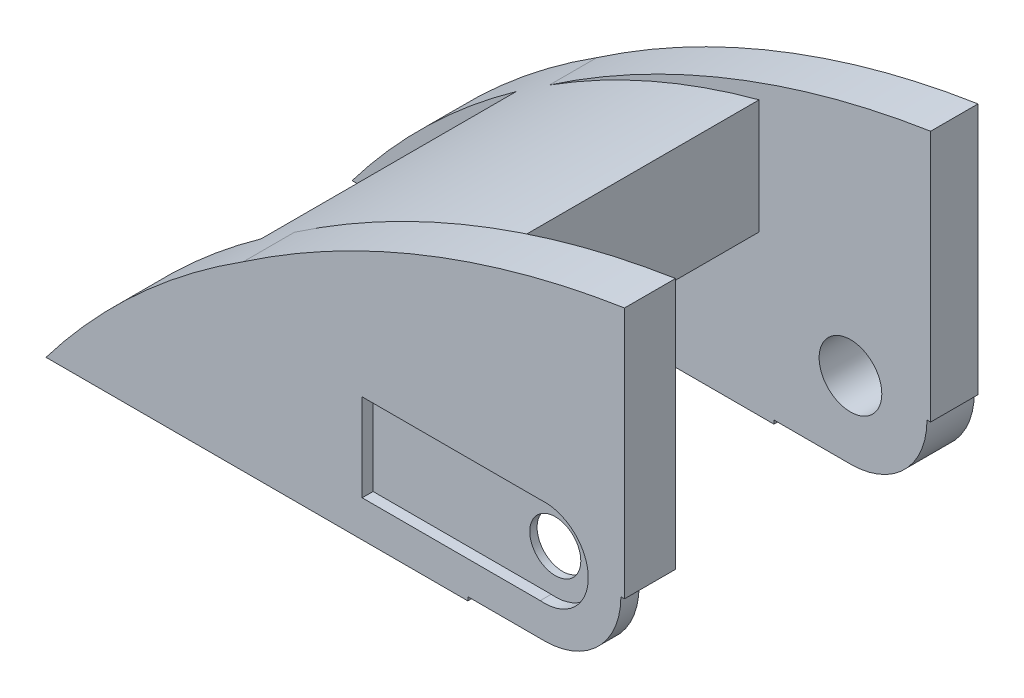
ISO-10303-21;
HEADER;
FILE_DESCRIPTION(('STEP AP214'),'2;1');
FILE_NAME('part.step','',(''),(''),'','','');
FILE_SCHEMA(('AUTOMOTIVE_DESIGN { 1 0 10303 214 1 1 1 1 }'));
ENDSEC;
DATA;
#1=APPLICATION_CONTEXT('core data for automotive mechanical design processes');
#2=APPLICATION_PROTOCOL_DEFINITION('international standard','automotive_design',2000,#1);
#3=PRODUCT_CONTEXT('',#1,'mechanical');
#4=PRODUCT('Part','Part','',(#3));
#5=PRODUCT_RELATED_PRODUCT_CATEGORY('part','',(#4));
#6=PRODUCT_DEFINITION_FORMATION('','',#4);
#7=PRODUCT_DEFINITION_CONTEXT('part definition',#1,'design');
#8=PRODUCT_DEFINITION('design','',#6,#7);
#9=PRODUCT_DEFINITION_SHAPE('','',#8);
#10=(LENGTH_UNIT() NAMED_UNIT(*) SI_UNIT(.MILLI.,.METRE.));
#11=(NAMED_UNIT(*) PLANE_ANGLE_UNIT() SI_UNIT($,.RADIAN.));
#12=(NAMED_UNIT(*) SI_UNIT($,.STERADIAN.) SOLID_ANGLE_UNIT());
#13=UNCERTAINTY_MEASURE_WITH_UNIT(LENGTH_MEASURE(1.E-05),#10,'distance_accuracy_value','');
#14=(GEOMETRIC_REPRESENTATION_CONTEXT(3) GLOBAL_UNCERTAINTY_ASSIGNED_CONTEXT((#13)) GLOBAL_UNIT_ASSIGNED_CONTEXT((#10,
#11,#12)) REPRESENTATION_CONTEXT('',''));
#15=CARTESIAN_POINT('',(0.,0.,0.));
#16=DIRECTION('',(0.,0.,1.));
#17=DIRECTION('',(1.,0.,0.));
#18=AXIS2_PLACEMENT_3D('',#15,#16,#17);
#19=CARTESIAN_POINT('',(0.,0.,-48.5));
#20=DIRECTION('',(0.,0.,1.));
#21=DIRECTION('',(1.,0.,0.));
#22=AXIS2_PLACEMENT_3D('',#19,#20,#21);
#23=CYLINDRICAL_SURFACE('',#22,3.5);
#24=CARTESIAN_POINT('',(0.,0.,-2.5));
#25=DIRECTION('',(0.,0.,-1.));
#26=DIRECTION('',(0.,1.,0.));
#27=AXIS2_PLACEMENT_3D('',#24,#25,#26);
#28=CIRCLE('',#27,3.5);
#29=CARTESIAN_POINT('',(3.5,0.,-2.5));
#30=VERTEX_POINT('',#29);
#31=EDGE_CURVE('E53',#30,#30,#28,.T.);
#32=CARTESIAN_POINT('',(0.,0.,-1.5));
#33=DIRECTION('',(0.,0.,1.));
#34=DIRECTION('',(1.,0.,0.));
#35=AXIS2_PLACEMENT_3D('',#32,#33,#34);
#36=CIRCLE('',#35,3.5);
#37=CARTESIAN_POINT('',(3.5,0.,-1.49999999999999));
#38=VERTEX_POINT('',#37);
#39=EDGE_CURVE('E233',#38,#38,#36,.F.);
#40=CARTESIAN_POINT('',(3.5,0.,-2.5));
#41=CARTESIAN_POINT('',(3.5,0.,-2.48958333333333));
#42=CARTESIAN_POINT('',(3.5,0.,-2.47916666666666));
#43=CARTESIAN_POINT('',(3.5,0.,-2.45833333333333));
#44=CARTESIAN_POINT('',(3.5,0.,-2.44791666666666));
#45=CARTESIAN_POINT('',(3.5,0.,-2.42708333333333));
#46=CARTESIAN_POINT('',(3.5,0.,-2.41666666666666));
#47=CARTESIAN_POINT('',(3.5,0.,-2.39583333333333));
#48=CARTESIAN_POINT('',(3.5,0.,-2.38541666666666));
#49=CARTESIAN_POINT('',(3.5,0.,-2.36458333333333));
#50=CARTESIAN_POINT('',(3.5,0.,-2.35416666666666));
#51=CARTESIAN_POINT('',(3.5,0.,-2.33333333333333));
#52=CARTESIAN_POINT('',(3.5,0.,-2.32291666666666));
#53=CARTESIAN_POINT('',(3.5,0.,-2.30208333333333));
#54=CARTESIAN_POINT('',(3.5,0.,-2.29166666666666));
#55=CARTESIAN_POINT('',(3.5,0.,-2.27083333333333));
#56=CARTESIAN_POINT('',(3.5,0.,-2.26041666666666));
#57=CARTESIAN_POINT('',(3.5,0.,-2.23958333333333));
#58=CARTESIAN_POINT('',(3.5,0.,-2.22916666666666));
#59=CARTESIAN_POINT('',(3.5,0.,-2.20833333333333));
#60=CARTESIAN_POINT('',(3.5,0.,-2.19791666666666));
#61=CARTESIAN_POINT('',(3.5,0.,-2.17708333333333));
#62=CARTESIAN_POINT('',(3.5,0.,-2.16666666666666));
#63=CARTESIAN_POINT('',(3.5,0.,-2.14583333333333));
#64=CARTESIAN_POINT('',(3.5,0.,-2.13541666666666));
#65=CARTESIAN_POINT('',(3.5,0.,-2.11458333333333));
#66=CARTESIAN_POINT('',(3.5,0.,-2.10416666666666));
#67=CARTESIAN_POINT('',(3.5,0.,-2.08333333333333));
#68=CARTESIAN_POINT('',(3.5,0.,-2.07291666666666));
#69=CARTESIAN_POINT('',(3.5,0.,-2.05208333333333));
#70=CARTESIAN_POINT('',(3.5,0.,-2.04166666666666));
#71=CARTESIAN_POINT('',(3.5,0.,-2.02083333333333));
#72=CARTESIAN_POINT('',(3.5,0.,-2.01041666666666));
#73=CARTESIAN_POINT('',(3.5,0.,-1.98958333333333));
#74=CARTESIAN_POINT('',(3.5,0.,-1.97916666666666));
#75=CARTESIAN_POINT('',(3.5,0.,-1.95833333333333));
#76=CARTESIAN_POINT('',(3.5,0.,-1.94791666666666));
#77=CARTESIAN_POINT('',(3.5,0.,-1.92708333333333));
#78=CARTESIAN_POINT('',(3.5,0.,-1.91666666666666));
#79=CARTESIAN_POINT('',(3.5,0.,-1.89583333333333));
#80=CARTESIAN_POINT('',(3.5,0.,-1.88541666666666));
#81=CARTESIAN_POINT('',(3.5,0.,-1.86458333333333));
#82=CARTESIAN_POINT('',(3.5,0.,-1.85416666666666));
#83=CARTESIAN_POINT('',(3.5,0.,-1.83333333333333));
#84=CARTESIAN_POINT('',(3.5,0.,-1.82291666666666));
#85=CARTESIAN_POINT('',(3.5,0.,-1.80208333333333));
#86=CARTESIAN_POINT('',(3.5,0.,-1.79166666666666));
#87=CARTESIAN_POINT('',(3.5,0.,-1.77083333333333));
#88=CARTESIAN_POINT('',(3.5,0.,-1.76041666666666));
#89=CARTESIAN_POINT('',(3.5,0.,-1.73958333333333));
#90=CARTESIAN_POINT('',(3.5,0.,-1.72916666666666));
#91=CARTESIAN_POINT('',(3.5,0.,-1.70833333333333));
#92=CARTESIAN_POINT('',(3.5,0.,-1.69791666666666));
#93=CARTESIAN_POINT('',(3.5,0.,-1.67708333333333));
#94=CARTESIAN_POINT('',(3.5,0.,-1.66666666666666));
#95=CARTESIAN_POINT('',(3.5,0.,-1.64583333333333));
#96=CARTESIAN_POINT('',(3.5,0.,-1.63541666666666));
#97=CARTESIAN_POINT('',(3.5,0.,-1.61458333333333));
#98=CARTESIAN_POINT('',(3.5,0.,-1.60416666666666));
#99=CARTESIAN_POINT('',(3.5,0.,-1.58333333333333));
#100=CARTESIAN_POINT('',(3.5,0.,-1.57291666666666));
#101=CARTESIAN_POINT('',(3.5,0.,-1.55208333333333));
#102=CARTESIAN_POINT('',(3.5,0.,-1.54166666666666));
#103=CARTESIAN_POINT('',(3.5,0.,-1.52083333333333));
#104=CARTESIAN_POINT('',(3.5,0.,-1.51041666666666));
#105=CARTESIAN_POINT('',(3.5,0.,-1.49999999999999));
#106=B_SPLINE_CURVE_WITH_KNOTS('',3,(#40,#41,#42,#43,#44,#45,#46,#47,#48,#49,#50,#51,#52,#53,
#54,#55,#56,#57,#58,#59,#60,#61,#62,#63,#64,#65,#66,#67,#68,#69,#70,#71,#72,#73,#74,#75,#76,#77,
#78,#79,#80,#81,#82,#83,#84,#85,#86,#87,#88,#89,#90,#91,#92,#93,#94,#95,#96,#97,#98,#99,#100,
#101,#102,#103,#104,#105),.UNSPECIFIED.,.F.,.F.,(4,2,2,2,2,2,2,2,2,2,2,2,2,2,2,2,2,2,2,2,2,2,2,
2,2,2,2,2,2,2,2,2,4),(0.,0.0312499999999966,0.0625000000000001,0.0937500000000036,0.125,
0.156249999999997,0.1875,0.218750000000004,0.25,0.281249999999997,0.3125,0.343750000000004,
0.375,0.406249999999997,0.4375,0.468750000000004,0.5,0.531249999999997,0.5625,0.593750000000004,
0.625000000000001,0.656249999999997,0.687500000000001,0.718750000000004,0.750000000000001,
0.781249999999997,0.812500000000001,0.843750000000004,0.875000000000001,0.906249999999997,
0.937500000000001,0.968750000000004,1.),.UNSPECIFIED.);
#107=EDGE_CURVE('BSEAM49',#30,#38,#106,.T.);
#108=ORIENTED_EDGE('',*,*,#31,.T.);
#109=ORIENTED_EDGE('',*,*,#39,.F.);
#110=ORIENTED_EDGE('',*,*,#107,.T.);
#111=ORIENTED_EDGE('',*,*,#107,.F.);
#112=EDGE_LOOP('',(#108,#110,#109,#111));
#113=FACE_BOUND('',#112,.T.);
#114=ADVANCED_FACE('F49',(#113),#23,.F.);
#115=CARTESIAN_POINT('',(11.,0.,-48.5));
#116=DIRECTION('',(-1.,0.,0.));
#117=DIRECTION('',(0.,0.,1.));
#118=AXIS2_PLACEMENT_3D('',#115,#116,#117);
#119=PLANE('',#118);
#120=DIRECTION('',(0.,0.,-1.));
#121=VECTOR('',#120,1.);
#122=CARTESIAN_POINT('',(11.,34.56,-41.5));
#123=LINE('',#122,#121);
#124=CARTESIAN_POINT('',(11.,34.56,-42.));
#125=VERTEX_POINT('',#124);
#126=CARTESIAN_POINT('',(11.,34.56,-48.5));
#127=VERTEX_POINT('',#126);
#128=EDGE_CURVE('E325',#125,#127,#123,.T.);
#129=ORIENTED_EDGE('',*,*,#128,.F.);
#130=DIRECTION('',(0.,1.,0.));
#131=VECTOR('',#130,1.);
#132=CARTESIAN_POINT('',(11.,0.,-42.));
#133=LINE('',#132,#131);
#134=CARTESIAN_POINT('',(11.,0.,-42.));
#135=VERTEX_POINT('',#134);
#136=EDGE_CURVE('E458',#135,#125,#133,.T.);
#137=ORIENTED_EDGE('',*,*,#136,.F.);
#138=DIRECTION('',(0.,0.,1.));
#139=VECTOR('',#138,1.);
#140=CARTESIAN_POINT('',(11.,0.,-48.5));
#141=LINE('',#140,#139);
#142=CARTESIAN_POINT('',(11.,0.,-48.5));
#143=VERTEX_POINT('',#142);
#144=EDGE_CURVE('E483',#143,#135,#141,.T.);
#145=ORIENTED_EDGE('',*,*,#144,.F.);
#146=DIRECTION('',(0.,-1.,0.));
#147=VECTOR('',#146,1.);
#148=CARTESIAN_POINT('',(11.,0.,-48.5));
#149=LINE('',#148,#147);
#150=EDGE_CURVE('E475',#127,#143,#149,.T.);
#151=ORIENTED_EDGE('',*,*,#150,.F.);
#152=EDGE_LOOP('',(#129,#137,#145,#151));
#153=FACE_BOUND('',#152,.T.);
#154=ADVANCED_FACE('F528',(#153),#119,.F.);
#155=CARTESIAN_POINT('',(30.4889753081487,-91.3330173495402,-41.5));
#156=DIRECTION('',(0.,0.,-1.));
#157=DIRECTION('',(-1.,0.,0.));
#158=AXIS2_PLACEMENT_3D('',#155,#156,#157);
#159=CYLINDRICAL_SURFACE('',#158,127.392589956925);
#160=CARTESIAN_POINT('',(30.4889753081487,-91.3330173495402,-42.));
#161=DIRECTION('',(0.,0.,1.));
#162=DIRECTION('',(1.,0.,0.));
#163=AXIS2_PLACEMENT_3D('',#160,#161,#162);
#164=CIRCLE('',#163,127.392589956925);
#165=CARTESIAN_POINT('',(-41.3051580301742,13.9023112912369,-42.));
#166=VERTEX_POINT('',#165);
#167=EDGE_CURVE('E316',#125,#166,#164,.T.);
#168=ORIENTED_EDGE('',*,*,#167,.F.);
#169=ORIENTED_EDGE('',*,*,#128,.T.);
#170=CARTESIAN_POINT('',(30.4889753081487,-91.3330173495402,-48.5));
#171=DIRECTION('',(0.,0.,1.));
#172=DIRECTION('',(1.,0.,0.));
#173=AXIS2_PLACEMENT_3D('',#170,#171,#172);
#174=CIRCLE('',#173,127.392589956925);
#175=CARTESIAN_POINT('',(-41.3051580301743,13.9023112912369,-48.5));
#176=VERTEX_POINT('',#175);
#177=EDGE_CURVE('E320',#127,#176,#174,.T.);
#178=ORIENTED_EDGE('',*,*,#177,.T.);
#179=DIRECTION('',(0.,0.,-1.));
#180=VECTOR('',#179,1.);
#181=CARTESIAN_POINT('',(-41.3051580301743,13.9023112912369,-41.5));
#182=LINE('',#181,#180);
#183=EDGE_CURVE('E324',#166,#176,#182,.T.);
#184=ORIENTED_EDGE('',*,*,#183,.F.);
#185=EDGE_LOOP('',(#168,#169,#178,#184));
#186=FACE_BOUND('',#185,.T.);
#187=ADVANCED_FACE('F534',(#186),#159,.T.);
#188=CARTESIAN_POINT('',(14.2922228853993,-73.7218968301527,-48.5));
#189=DIRECTION('',(0.,0.,1.));
#190=DIRECTION('',(1.,0.,0.));
#191=AXIS2_PLACEMENT_3D('',#188,#189,#190);
#192=CYLINDRICAL_SURFACE('',#191,103.774132680413);
#193=DIRECTION('',(0.,0.,1.));
#194=VECTOR('',#193,1.);
#195=CARTESIAN_POINT('',(-12.5312796553273,26.5256484017363,-48.5));
#196=LINE('',#195,#194);
#197=CARTESIAN_POINT('',(-12.5312796553273,26.5256484017363,-7.00000000000001));
#198=VERTEX_POINT('',#197);
#199=CARTESIAN_POINT('',(-12.5312796553273,26.5256484017363,-42.));
#200=VERTEX_POINT('',#199);
#201=EDGE_CURVE('E437',#198,#200,#196,.F.);
#202=ORIENTED_EDGE('',*,*,#201,.T.);
#203=CARTESIAN_POINT('',(14.2922228853993,-73.7218968301527,-42.));
#204=DIRECTION('',(0.,0.,1.));
#205=DIRECTION('',(1.,0.,0.));
#206=AXIS2_PLACEMENT_3D('',#203,#204,#205);
#207=CIRCLE('',#206,103.774132680413);
#208=EDGE_CURVE('E313',#200,#166,#207,.T.);
#209=ORIENTED_EDGE('',*,*,#208,.T.);
#210=ORIENTED_EDGE('',*,*,#183,.T.);
#211=CARTESIAN_POINT('',(14.2922228853993,-73.7218968301527,-48.5));
#212=DIRECTION('',(0.,0.,-1.));
#213=DIRECTION('',(-1.,0.,0.));
#214=AXIS2_PLACEMENT_3D('',#211,#212,#213);
#215=CIRCLE('',#214,103.774132680413);
#216=CARTESIAN_POINT('',(-68.3820431929861,-11.,-48.5));
#217=VERTEX_POINT('',#216);
#218=EDGE_CURVE('E417',#217,#176,#215,.T.);
#219=ORIENTED_EDGE('',*,*,#218,.F.);
#220=DIRECTION('',(0.,0.,1.));
#221=VECTOR('',#220,1.);
#222=CARTESIAN_POINT('',(-68.3820431929861,-11.,-48.5));
#223=LINE('',#222,#221);
#224=CARTESIAN_POINT('',(-68.3820431929861,-11.,-42.));
#225=VERTEX_POINT('',#224);
#226=EDGE_CURVE('E424',#217,#225,#223,.T.);
#227=ORIENTED_EDGE('',*,*,#226,.T.);
#228=CARTESIAN_POINT('',(14.2922228853993,-73.7218968301527,-42.));
#229=DIRECTION('',(0.,0.,1.));
#230=DIRECTION('',(1.,0.,0.));
#231=AXIS2_PLACEMENT_3D('',#228,#229,#230);
#232=CIRCLE('',#231,103.774132680413);
#233=CARTESIAN_POINT('',(-45.882131556072,10.8246446787948,-42.));
#234=VERTEX_POINT('',#233);
#235=EDGE_CURVE('E430',#225,#234,#232,.F.);
#236=ORIENTED_EDGE('',*,*,#235,.T.);
#237=DIRECTION('',(0.,0.,1.));
#238=VECTOR('',#237,1.);
#239=CARTESIAN_POINT('',(-45.882131556072,10.8246446787948,-48.5));
#240=LINE('',#239,#238);
#241=CARTESIAN_POINT('',(-45.882131556072,10.8246446787948,-7.00000000000001));
#242=VERTEX_POINT('',#241);
#243=EDGE_CURVE('E427',#234,#242,#240,.T.);
#244=ORIENTED_EDGE('',*,*,#243,.T.);
#245=CARTESIAN_POINT('',(14.2922228853993,-73.7218968301527,-6.99999999999999));
#246=DIRECTION('',(0.,0.,1.));
#247=DIRECTION('',(0.,-1.,0.));
#248=AXIS2_PLACEMENT_3D('',#245,#246,#247);
#249=CIRCLE('',#248,103.774132680413);
#250=CARTESIAN_POINT('',(-68.3820431929861,-11.,-7.00000000000001));
#251=VERTEX_POINT('',#250);
#252=EDGE_CURVE('E433',#251,#242,#249,.F.);
#253=ORIENTED_EDGE('',*,*,#252,.F.);
#254=CARTESIAN_POINT('',(-68.3820431929861,-11.,0.));
#255=VERTEX_POINT('',#254);
#256=EDGE_CURVE('E421',#251,#255,#223,.T.);
#257=ORIENTED_EDGE('',*,*,#256,.T.);
#258=CARTESIAN_POINT('',(14.2922228853993,-73.7218968301527,0.));
#259=DIRECTION('',(0.,0.,-1.));
#260=DIRECTION('',(-1.,0.,0.));
#261=AXIS2_PLACEMENT_3D('',#258,#259,#260);
#262=CIRCLE('',#261,103.774132680413);
#263=CARTESIAN_POINT('',(-41.3051580301742,13.902311291237,0.));
#264=VERTEX_POINT('',#263);
#265=EDGE_CURVE('E416',#255,#264,#262,.T.);
#266=ORIENTED_EDGE('',*,*,#265,.T.);
#267=DIRECTION('',(0.,0.,1.));
#268=VECTOR('',#267,1.);
#269=CARTESIAN_POINT('',(-41.3051580301743,13.9023112912369,-7.));
#270=LINE('',#269,#268);
#271=CARTESIAN_POINT('',(-41.3051580301743,13.9023112912369,-7.));
#272=VERTEX_POINT('',#271);
#273=EDGE_CURVE('E339',#272,#264,#270,.T.);
#274=ORIENTED_EDGE('',*,*,#273,.F.);
#275=CARTESIAN_POINT('',(14.2922228853993,-73.7218968301527,-7.));
#276=DIRECTION('',(0.,0.,1.));
#277=DIRECTION('',(1.,0.,0.));
#278=AXIS2_PLACEMENT_3D('',#275,#276,#277);
#279=CIRCLE('',#278,103.774132680413);
#280=EDGE_CURVE('E11',#198,#272,#279,.T.);
#281=ORIENTED_EDGE('',*,*,#280,.F.);
#282=EDGE_LOOP('',(#202,#209,#210,#219,#227,#236,#244,#253,#257,#266,#274,#281));
#283=FACE_BOUND('',#282,.T.);
#284=ADVANCED_FACE('F556',(#283),#192,.T.);
#285=CARTESIAN_POINT('',(12.,-12.,-7.));
#286=DIRECTION('',(0.,0.,1.));
#287=DIRECTION('',(0.,-1.,0.));
#288=AXIS2_PLACEMENT_3D('',#285,#286,#287);
#289=PLANE('',#288);
#290=DIRECTION('',(1.,0.,0.));
#291=VECTOR('',#290,1.);
#292=CARTESIAN_POINT('',(12.,0.,-7.));
#293=LINE('',#292,#291);
#294=CARTESIAN_POINT('',(9.5,0.,-7.));
#295=VERTEX_POINT('',#294);
#296=CARTESIAN_POINT('',(11.,0.,-7.00000000000001));
#297=VERTEX_POINT('',#296);
#298=EDGE_CURVE('E406',#295,#297,#293,.T.);
#299=ORIENTED_EDGE('',*,*,#298,.F.);
#300=CARTESIAN_POINT('',(0.,0.,-7.));
#301=DIRECTION('',(0.,0.,-1.));
#302=DIRECTION('',(0.,1.,0.));
#303=AXIS2_PLACEMENT_3D('',#300,#301,#302);
#304=CIRCLE('',#303,9.5);
#305=CARTESIAN_POINT('',(-9.5,0.,-7.));
#306=VERTEX_POINT('',#305);
#307=EDGE_CURVE('E59',#306,#295,#304,.T.);
#308=ORIENTED_EDGE('',*,*,#307,.F.);
#309=DIRECTION('',(-1.,0.,0.));
#310=VECTOR('',#309,1.);
#311=CARTESIAN_POINT('',(12.,0.,-7.));
#312=LINE('',#311,#310);
#313=CARTESIAN_POINT('',(-10.5,0.,-7.));
#314=VERTEX_POINT('',#313);
#315=EDGE_CURVE('E309',#306,#314,#312,.T.);
#316=ORIENTED_EDGE('',*,*,#315,.T.);
#317=DIRECTION('',(0.,-1.,0.));
#318=VECTOR('',#317,1.);
#319=CARTESIAN_POINT('',(-10.5,-12.,-7.));
#320=LINE('',#319,#318);
#321=CARTESIAN_POINT('',(-10.5,-11.,-7.00000000000002));
#322=VERTEX_POINT('',#321);
#323=EDGE_CURVE('E398',#314,#322,#320,.T.);
#324=ORIENTED_EDGE('',*,*,#323,.T.);
#325=DIRECTION('',(-1.,0.,0.));
#326=VECTOR('',#325,1.);
#327=CARTESIAN_POINT('',(0.,-11.,-7.));
#328=LINE('',#327,#326);
#329=EDGE_CURVE('E469',#322,#251,#328,.T.);
#330=ORIENTED_EDGE('',*,*,#329,.T.);
#331=ORIENTED_EDGE('',*,*,#252,.T.);
#332=DIRECTION('',(1.,0.,0.));
#333=VECTOR('',#332,1.);
#334=CARTESIAN_POINT('',(12.,10.8246446787948,-7.));
#335=LINE('',#334,#333);
#336=CARTESIAN_POINT('',(-12.5312796553273,10.8246446787948,-7.));
#337=VERTEX_POINT('',#336);
#338=EDGE_CURVE('E447',#242,#337,#335,.T.);
#339=ORIENTED_EDGE('',*,*,#338,.T.);
#340=DIRECTION('',(0.,1.,0.));
#341=VECTOR('',#340,1.);
#342=CARTESIAN_POINT('',(-12.5312796553273,-12.,-7.));
#343=LINE('',#342,#341);
#344=EDGE_CURVE('E454',#337,#198,#343,.T.);
#345=ORIENTED_EDGE('',*,*,#344,.T.);
#346=ORIENTED_EDGE('',*,*,#280,.T.);
#347=CARTESIAN_POINT('',(30.4889753081487,-91.3330173495402,-7.));
#348=DIRECTION('',(0.,0.,1.));
#349=DIRECTION('',(1.,0.,0.));
#350=AXIS2_PLACEMENT_3D('',#347,#348,#349);
#351=CIRCLE('',#350,127.392589956925);
#352=CARTESIAN_POINT('',(11.,34.56,-7.));
#353=VERTEX_POINT('',#352);
#354=EDGE_CURVE('E331',#353,#272,#351,.T.);
#355=ORIENTED_EDGE('',*,*,#354,.F.);
#356=DIRECTION('',(0.,-1.,0.));
#357=VECTOR('',#356,1.);
#358=CARTESIAN_POINT('',(11.,-12.,-7.));
#359=LINE('',#358,#357);
#360=EDGE_CURVE('E486',#353,#297,#359,.T.);
#361=ORIENTED_EDGE('',*,*,#360,.T.);
#362=EDGE_LOOP('',(#299,#308,#316,#324,#330,#331,#339,#345,#346,#355,#361));
#363=FACE_BOUND('',#362,.T.);
#364=ADVANCED_FACE('F558',(#363),#289,.F.);
#365=CARTESIAN_POINT('',(0.,0.,-48.5));
#366=DIRECTION('',(0.,0.,-1.));
#367=DIRECTION('',(-1.,0.,0.));
#368=AXIS2_PLACEMENT_3D('',#365,#366,#367);
#369=PLANE('',#368);
#370=CARTESIAN_POINT('',(0.,0.,-48.5));
#371=DIRECTION('',(0.,0.,1.));
#372=DIRECTION('',(1.,0.,0.));
#373=AXIS2_PLACEMENT_3D('',#370,#371,#372);
#374=CIRCLE('',#373,4.3);
#375=CARTESIAN_POINT('',(4.3,0.,-48.5));
#376=VERTEX_POINT('',#375);
#377=EDGE_CURVE('E279',#376,#376,#374,.T.);
#378=ORIENTED_EDGE('',*,*,#377,.T.);
#379=EDGE_LOOP('',(#378));
#380=FACE_BOUND('',#379,.T.);
#381=ORIENTED_EDGE('',*,*,#150,.T.);
#382=DIRECTION('',(1.,0.,0.));
#383=VECTOR('',#382,1.);
#384=CARTESIAN_POINT('',(0.,0.,-48.5));
#385=LINE('',#384,#383);
#386=CARTESIAN_POINT('',(10.5,0.,-48.5));
#387=VERTEX_POINT('',#386);
#388=EDGE_CURVE('E359',#387,#143,#385,.T.);
#389=ORIENTED_EDGE('',*,*,#388,.F.);
#390=CARTESIAN_POINT('',(0.,0.,-48.5));
#391=DIRECTION('',(0.,0.,1.));
#392=DIRECTION('',(1.,0.,0.));
#393=AXIS2_PLACEMENT_3D('',#390,#391,#392);
#394=CIRCLE('',#393,10.5);
#395=CARTESIAN_POINT('',(0.,-10.5,-48.5));
#396=VERTEX_POINT('',#395);
#397=EDGE_CURVE('E347',#396,#387,#394,.T.);
#398=ORIENTED_EDGE('',*,*,#397,.F.);
#399=DIRECTION('',(-1.,0.,0.));
#400=VECTOR('',#399,1.);
#401=CARTESIAN_POINT('',(0.,-10.5,-48.5));
#402=LINE('',#401,#400);
#403=CARTESIAN_POINT('',(-10.5,-10.5,-48.5));
#404=VERTEX_POINT('',#403);
#405=EDGE_CURVE('E350',#396,#404,#402,.T.);
#406=ORIENTED_EDGE('',*,*,#405,.T.);
#407=DIRECTION('',(0.,-1.,0.));
#408=VECTOR('',#407,1.);
#409=CARTESIAN_POINT('',(-10.5,0.,-48.5));
#410=LINE('',#409,#408);
#411=CARTESIAN_POINT('',(-10.5,-11.,-48.5));
#412=VERTEX_POINT('',#411);
#413=EDGE_CURVE('E355',#404,#412,#410,.T.);
#414=ORIENTED_EDGE('',*,*,#413,.T.);
#415=DIRECTION('',(-1.,0.,0.));
#416=VECTOR('',#415,1.);
#417=CARTESIAN_POINT('',(0.,-11.,-48.5));
#418=LINE('',#417,#416);
#419=EDGE_CURVE('E465',#412,#217,#418,.T.);
#420=ORIENTED_EDGE('',*,*,#419,.T.);
#421=ORIENTED_EDGE('',*,*,#218,.T.);
#422=ORIENTED_EDGE('',*,*,#177,.F.);
#423=EDGE_LOOP('',(#381,#389,#398,#406,#414,#420,#421,#422));
#424=FACE_BOUND('',#423,.T.);
#425=ADVANCED_FACE('F507',(#380,#424),#369,.T.);
#426=CARTESIAN_POINT('',(0.,0.,-42.));
#427=DIRECTION('',(0.,0.,1.));
#428=DIRECTION('',(1.,0.,0.));
#429=AXIS2_PLACEMENT_3D('',#426,#427,#428);
#430=PLANE('',#429);
#431=CARTESIAN_POINT('',(0.,0.,-42.));
#432=DIRECTION('',(0.,0.,1.));
#433=DIRECTION('',(1.,0.,0.));
#434=AXIS2_PLACEMENT_3D('',#431,#432,#433);
#435=CIRCLE('',#434,4.3);
#436=CARTESIAN_POINT('',(4.3,0.,-42.));
#437=VERTEX_POINT('',#436);
#438=EDGE_CURVE('E283',#437,#437,#435,.T.);
#439=ORIENTED_EDGE('',*,*,#438,.F.);
#440=EDGE_LOOP('',(#439));
#441=FACE_BOUND('',#440,.T.);
#442=CARTESIAN_POINT('',(0.,0.,-42.));
#443=DIRECTION('',(0.,0.,1.));
#444=DIRECTION('',(1.,0.,0.));
#445=AXIS2_PLACEMENT_3D('',#442,#443,#444);
#446=CIRCLE('',#445,10.5);
#447=CARTESIAN_POINT('',(0.,-10.5,-42.));
#448=VERTEX_POINT('',#447);
#449=CARTESIAN_POINT('',(10.5,0.,-42.));
#450=VERTEX_POINT('',#449);
#451=EDGE_CURVE('E412',#448,#450,#446,.T.);
#452=ORIENTED_EDGE('',*,*,#451,.T.);
#453=DIRECTION('',(1.,0.,0.));
#454=VECTOR('',#453,1.);
#455=CARTESIAN_POINT('',(0.,0.,-42.));
#456=LINE('',#455,#454);
#457=EDGE_CURVE('E402',#450,#135,#456,.T.);
#458=ORIENTED_EDGE('',*,*,#457,.T.);
#459=ORIENTED_EDGE('',*,*,#136,.T.);
#460=ORIENTED_EDGE('',*,*,#167,.T.);
#461=ORIENTED_EDGE('',*,*,#208,.F.);
#462=DIRECTION('',(0.,1.,0.));
#463=VECTOR('',#462,1.);
#464=CARTESIAN_POINT('',(-12.5312796553273,0.,-42.));
#465=LINE('',#464,#463);
#466=CARTESIAN_POINT('',(-12.5312796553273,10.8246446787948,-42.));
#467=VERTEX_POINT('',#466);
#468=EDGE_CURVE('E450',#467,#200,#465,.T.);
#469=ORIENTED_EDGE('',*,*,#468,.F.);
#470=DIRECTION('',(1.,0.,0.));
#471=VECTOR('',#470,1.);
#472=CARTESIAN_POINT('',(0.,10.8246446787948,-42.));
#473=LINE('',#472,#471);
#474=EDGE_CURVE('E444',#234,#467,#473,.T.);
#475=ORIENTED_EDGE('',*,*,#474,.F.);
#476=ORIENTED_EDGE('',*,*,#235,.F.);
#477=DIRECTION('',(1.,0.,0.));
#478=VECTOR('',#477,1.);
#479=CARTESIAN_POINT('',(0.,-11.,-42.));
#480=LINE('',#479,#478);
#481=CARTESIAN_POINT('',(-10.5,-11.,-42.));
#482=VERTEX_POINT('',#481);
#483=EDGE_CURVE('E461',#225,#482,#480,.T.);
#484=ORIENTED_EDGE('',*,*,#483,.T.);
#485=DIRECTION('',(0.,-1.,0.));
#486=VECTOR('',#485,1.);
#487=CARTESIAN_POINT('',(-10.5,0.,-42.));
#488=LINE('',#487,#486);
#489=CARTESIAN_POINT('',(-10.5,-10.5,-42.));
#490=VERTEX_POINT('',#489);
#491=EDGE_CURVE('E380',#490,#482,#488,.T.);
#492=ORIENTED_EDGE('',*,*,#491,.F.);
#493=DIRECTION('',(-1.,0.,0.));
#494=VECTOR('',#493,1.);
#495=CARTESIAN_POINT('',(0.,-10.5,-42.));
#496=LINE('',#495,#494);
#497=EDGE_CURVE('E409',#448,#490,#496,.T.);
#498=ORIENTED_EDGE('',*,*,#497,.F.);
#499=EDGE_LOOP('',(#452,#458,#459,#460,#461,#469,#475,#476,#484,#492,#498));
#500=FACE_BOUND('',#499,.T.);
#501=ADVANCED_FACE('F503',(#441,#500),#430,.T.);
#502=CARTESIAN_POINT('',(0.,0.,0.));
#503=DIRECTION('',(0.,0.,1.));
#504=DIRECTION('',(1.,0.,0.));
#505=AXIS2_PLACEMENT_3D('',#502,#503,#504);
#506=PLANE('',#505);
#507=CARTESIAN_POINT('',(0.,0.,0.));
#508=DIRECTION('',(0.,0.,1.));
#509=DIRECTION('',(1.,0.,0.));
#510=AXIS2_PLACEMENT_3D('',#507,#508,#509);
#511=CIRCLE('',#510,6.02637531229292);
#512=CARTESIAN_POINT('',(-0.563204585043083,-6.,0.));
#513=VERTEX_POINT('',#512);
#514=CARTESIAN_POINT('',(-0.563204585043085,6.,0.));
#515=VERTEX_POINT('',#514);
#516=EDGE_CURVE('E67',#513,#515,#511,.T.);
#517=ORIENTED_EDGE('',*,*,#516,.F.);
#518=DIRECTION('',(-1.,0.,0.));
#519=VECTOR('',#518,1.);
#520=CARTESIAN_POINT('',(0.,-6.,0.));
#521=LINE('',#520,#519);
#522=CARTESIAN_POINT('',(-25.,-6.,0.));
#523=VERTEX_POINT('',#522);
#524=EDGE_CURVE('E249',#513,#523,#521,.T.);
#525=ORIENTED_EDGE('',*,*,#524,.T.);
#526=DIRECTION('',(0.,-1.,0.));
#527=VECTOR('',#526,1.);
#528=CARTESIAN_POINT('',(-25.,0.,0.));
#529=LINE('',#528,#527);
#530=CARTESIAN_POINT('',(-25.,6.,0.));
#531=VERTEX_POINT('',#530);
#532=EDGE_CURVE('E253',#531,#523,#529,.T.);
#533=ORIENTED_EDGE('',*,*,#532,.F.);
#534=DIRECTION('',(-1.,0.,0.));
#535=VECTOR('',#534,1.);
#536=CARTESIAN_POINT('',(0.,6.,0.));
#537=LINE('',#536,#535);
#538=EDGE_CURVE('E265',#515,#531,#537,.T.);
#539=ORIENTED_EDGE('',*,*,#538,.F.);
#540=EDGE_LOOP('',(#517,#525,#533,#539));
#541=FACE_BOUND('',#540,.T.);
#542=CARTESIAN_POINT('',(0.,0.,0.));
#543=DIRECTION('',(0.,0.,1.));
#544=DIRECTION('',(1.,0.,0.));
#545=AXIS2_PLACEMENT_3D('',#542,#543,#544);
#546=CIRCLE('',#545,10.5);
#547=CARTESIAN_POINT('',(0.,-10.5,0.));
#548=VERTEX_POINT('',#547);
#549=CARTESIAN_POINT('',(10.5,0.,0.));
#550=VERTEX_POINT('',#549);
#551=EDGE_CURVE('E343',#548,#550,#546,.T.);
#552=ORIENTED_EDGE('',*,*,#551,.T.);
#553=DIRECTION('',(1.,0.,0.));
#554=VECTOR('',#553,1.);
#555=CARTESIAN_POINT('',(0.,0.,0.));
#556=LINE('',#555,#554);
#557=CARTESIAN_POINT('',(11.,0.,0.));
#558=VERTEX_POINT('',#557);
#559=EDGE_CURVE('E351',#550,#558,#556,.T.);
#560=ORIENTED_EDGE('',*,*,#559,.T.);
#561=DIRECTION('',(0.,-1.,0.));
#562=VECTOR('',#561,1.);
#563=CARTESIAN_POINT('',(11.,0.,0.));
#564=LINE('',#563,#562);
#565=CARTESIAN_POINT('',(11.,34.56,0.));
#566=VERTEX_POINT('',#565);
#567=EDGE_CURVE('E472',#566,#558,#564,.T.);
#568=ORIENTED_EDGE('',*,*,#567,.F.);
#569=CARTESIAN_POINT('',(30.4889753081487,-91.3330173495402,0.));
#570=DIRECTION('',(0.,0.,1.));
#571=DIRECTION('',(1.,0.,0.));
#572=AXIS2_PLACEMENT_3D('',#569,#570,#571);
#573=CIRCLE('',#572,127.392589956925);
#574=EDGE_CURVE('E328',#566,#264,#573,.T.);
#575=ORIENTED_EDGE('',*,*,#574,.T.);
#576=ORIENTED_EDGE('',*,*,#265,.F.);
#577=DIRECTION('',(-1.,0.,0.));
#578=VECTOR('',#577,1.);
#579=CARTESIAN_POINT('',(0.,-11.,0.));
#580=LINE('',#579,#578);
#581=CARTESIAN_POINT('',(-10.5,-11.,0.));
#582=VERTEX_POINT('',#581);
#583=EDGE_CURVE('E468',#582,#255,#580,.T.);
#584=ORIENTED_EDGE('',*,*,#583,.F.);
#585=DIRECTION('',(0.,-1.,0.));
#586=VECTOR('',#585,1.);
#587=CARTESIAN_POINT('',(-10.5,0.,0.));
#588=LINE('',#587,#586);
#589=CARTESIAN_POINT('',(-10.5,-10.5,0.));
#590=VERTEX_POINT('',#589);
#591=EDGE_CURVE('E370',#590,#582,#588,.T.);
#592=ORIENTED_EDGE('',*,*,#591,.F.);
#593=DIRECTION('',(-1.,0.,0.));
#594=VECTOR('',#593,1.);
#595=CARTESIAN_POINT('',(0.,-10.5,0.));
#596=LINE('',#595,#594);
#597=EDGE_CURVE('E366',#548,#590,#596,.T.);
#598=ORIENTED_EDGE('',*,*,#597,.F.);
#599=EDGE_LOOP('',(#552,#560,#568,#575,#576,#584,#592,#598));
#600=FACE_BOUND('',#599,.T.);
#601=ADVANCED_FACE('F506',(#541,#600),#506,.T.);
#602=CARTESIAN_POINT('',(0.,-11.,-7.));
#603=DIRECTION('',(0.,1.,0.));
#604=DIRECTION('',(-1.,0.,0.));
#605=AXIS2_PLACEMENT_3D('',#602,#603,#604);
#606=PLANE('',#605);
#607=ORIENTED_EDGE('',*,*,#329,.F.);
#608=DIRECTION('',(0.,0.,1.));
#609=VECTOR('',#608,1.);
#610=CARTESIAN_POINT('',(-10.5,-11.,-48.5));
#611=LINE('',#610,#609);
#612=EDGE_CURVE('E386',#322,#582,#611,.T.);
#613=ORIENTED_EDGE('',*,*,#612,.T.);
#614=ORIENTED_EDGE('',*,*,#583,.T.);
#615=ORIENTED_EDGE('',*,*,#256,.F.);
#616=EDGE_LOOP('',(#607,#613,#614,#615));
#617=FACE_BOUND('',#616,.T.);
#618=ADVANCED_FACE('F648',(#617),#606,.F.);
#619=CARTESIAN_POINT('',(0.,0.,-2.5));
#620=DIRECTION('',(0.,0.,-1.));
#621=DIRECTION('',(0.,1.,0.));
#622=AXIS2_PLACEMENT_3D('',#619,#620,#621);
#623=PLANE('',#622);
#624=ORIENTED_EDGE('',*,*,#31,.F.);
#625=EDGE_LOOP('',(#624));
#626=FACE_BOUND('',#625,.T.);
#627=CARTESIAN_POINT('',(0.,0.,-2.5));
#628=DIRECTION('',(0.,0.,-1.));
#629=DIRECTION('',(0.,1.,0.));
#630=AXIS2_PLACEMENT_3D('',#627,#628,#629);
#631=CIRCLE('',#630,9.5);
#632=CARTESIAN_POINT('',(-9.5,0.,-2.5));
#633=VERTEX_POINT('',#632);
#634=CARTESIAN_POINT('',(9.5,0.,-2.5));
#635=VERTEX_POINT('',#634);
#636=EDGE_CURVE('E490',#633,#635,#631,.T.);
#637=ORIENTED_EDGE('',*,*,#636,.T.);
#638=DIRECTION('',(1.,0.,0.));
#639=VECTOR('',#638,1.);
#640=CARTESIAN_POINT('',(0.,0.,-2.5));
#641=LINE('',#640,#639);
#642=CARTESIAN_POINT('',(10.5,0.,-2.5));
#643=VERTEX_POINT('',#642);
#644=EDGE_CURVE('E288',#635,#643,#641,.T.);
#645=ORIENTED_EDGE('',*,*,#644,.T.);
#646=CARTESIAN_POINT('',(0.,0.,-2.5));
#647=DIRECTION('',(0.,0.,1.));
#648=DIRECTION('',(1.,0.,0.));
#649=AXIS2_PLACEMENT_3D('',#646,#647,#648);
#650=CIRCLE('',#649,10.5);
#651=CARTESIAN_POINT('',(0.,-10.5,-2.5));
#652=VERTEX_POINT('',#651);
#653=EDGE_CURVE('E306',#643,#652,#650,.F.);
#654=ORIENTED_EDGE('',*,*,#653,.T.);
#655=DIRECTION('',(1.,0.,0.));
#656=VECTOR('',#655,1.);
#657=CARTESIAN_POINT('',(0.,-10.5,-2.5));
#658=LINE('',#657,#656);
#659=CARTESIAN_POINT('',(-10.5,-10.5,-2.50000000000002));
#660=VERTEX_POINT('',#659);
#661=EDGE_CURVE('E284',#660,#652,#658,.T.);
#662=ORIENTED_EDGE('',*,*,#661,.F.);
#663=DIRECTION('',(0.,1.,0.));
#664=VECTOR('',#663,1.);
#665=CARTESIAN_POINT('',(-10.5,0.,-2.5));
#666=LINE('',#665,#664);
#667=CARTESIAN_POINT('',(-10.5,0.,-2.5));
#668=VERTEX_POINT('',#667);
#669=EDGE_CURVE('E75',#660,#668,#666,.T.);
#670=ORIENTED_EDGE('',*,*,#669,.T.);
#671=EDGE_CURVE('E291',#668,#633,#641,.T.);
#672=ORIENTED_EDGE('',*,*,#671,.T.);
#673=EDGE_LOOP('',(#637,#645,#654,#662,#670,#672));
#674=FACE_BOUND('',#673,.T.);
#675=ADVANCED_FACE('F51',(#626,#674),#623,.T.);
#676=CARTESIAN_POINT('',(0.,0.,-2.5));
#677=DIRECTION('',(0.,0.,-1.));
#678=DIRECTION('',(0.,1.,0.));
#679=AXIS2_PLACEMENT_3D('',#676,#677,#678);
#680=CYLINDRICAL_SURFACE('',#679,9.5);
#681=ORIENTED_EDGE('',*,*,#307,.T.);
#682=DIRECTION('',(0.,0.,-1.));
#683=VECTOR('',#682,1.);
#684=CARTESIAN_POINT('',(9.5,0.,-2.5));
#685=LINE('',#684,#683);
#686=EDGE_CURVE('E302',#635,#295,#685,.T.);
#687=ORIENTED_EDGE('',*,*,#686,.F.);
#688=ORIENTED_EDGE('',*,*,#636,.F.);
#689=DIRECTION('',(0.,0.,-1.));
#690=VECTOR('',#689,1.);
#691=CARTESIAN_POINT('',(-9.5,0.,-2.5));
#692=LINE('',#691,#690);
#693=EDGE_CURVE('E298',#633,#306,#692,.T.);
#694=ORIENTED_EDGE('',*,*,#693,.T.);
#695=EDGE_LOOP('',(#681,#687,#688,#694));
#696=FACE_BOUND('',#695,.T.);
#697=ADVANCED_FACE('F632',(#696),#680,.F.);
#698=ORIENTED_EDGE('',*,*,#360,.F.);
#699=DIRECTION('',(0.,0.,1.));
#700=VECTOR('',#699,1.);
#701=CARTESIAN_POINT('',(11.,34.56,-7.));
#702=LINE('',#701,#700);
#703=EDGE_CURVE('E335',#353,#566,#702,.T.);
#704=ORIENTED_EDGE('',*,*,#703,.T.);
#705=ORIENTED_EDGE('',*,*,#567,.T.);
#706=EDGE_CURVE('E479',#297,#558,#141,.T.);
#707=ORIENTED_EDGE('',*,*,#706,.F.);
#708=EDGE_LOOP('',(#698,#704,#705,#707));
#709=FACE_BOUND('',#708,.T.);
#710=ADVANCED_FACE('F579',(#709),#119,.F.);
#711=ORIENTED_EDGE('',*,*,#419,.F.);
#712=EDGE_CURVE('E382',#412,#482,#611,.T.);
#713=ORIENTED_EDGE('',*,*,#712,.T.);
#714=ORIENTED_EDGE('',*,*,#483,.F.);
#715=ORIENTED_EDGE('',*,*,#226,.F.);
#716=EDGE_LOOP('',(#711,#713,#714,#715));
#717=FACE_BOUND('',#716,.T.);
#718=ADVANCED_FACE('F553',(#717),#606,.F.);
#719=CARTESIAN_POINT('',(-12.5312796553273,10.8246446787948,-44.75));
#720=DIRECTION('',(1.,0.,0.));
#721=DIRECTION('',(0.,0.,-1.));
#722=AXIS2_PLACEMENT_3D('',#719,#720,#721);
#723=PLANE('',#722);
#724=ORIENTED_EDGE('',*,*,#201,.F.);
#725=ORIENTED_EDGE('',*,*,#344,.F.);
#726=DIRECTION('',(0.,0.,1.));
#727=VECTOR('',#726,1.);
#728=CARTESIAN_POINT('',(-12.5312796553273,10.8246446787948,-44.75));
#729=LINE('',#728,#727);
#730=EDGE_CURVE('E440',#467,#337,#729,.T.);
#731=ORIENTED_EDGE('',*,*,#730,.F.);
#732=ORIENTED_EDGE('',*,*,#468,.T.);
#733=EDGE_LOOP('',(#724,#725,#731,#732));
#734=FACE_BOUND('',#733,.T.);
#735=ADVANCED_FACE('F542',(#734),#723,.T.);
#736=CARTESIAN_POINT('',(-47.5312796553273,10.8246446787948,-44.75));
#737=DIRECTION('',(0.,-1.,0.));
#738=DIRECTION('',(0.,0.,-1.));
#739=AXIS2_PLACEMENT_3D('',#736,#737,#738);
#740=PLANE('',#739);
#741=ORIENTED_EDGE('',*,*,#243,.F.);
#742=ORIENTED_EDGE('',*,*,#474,.T.);
#743=ORIENTED_EDGE('',*,*,#730,.T.);
#744=ORIENTED_EDGE('',*,*,#338,.F.);
#745=EDGE_LOOP('',(#741,#742,#743,#744));
#746=FACE_BOUND('',#745,.T.);
#747=ADVANCED_FACE('F547',(#746),#740,.T.);
#748=CARTESIAN_POINT('',(0.,0.,-48.5));
#749=DIRECTION('',(0.,-1.,0.));
#750=DIRECTION('',(0.,0.,-1.));
#751=AXIS2_PLACEMENT_3D('',#748,#749,#750);
#752=PLANE('',#751);
#753=DIRECTION('',(0.,0.,1.));
#754=VECTOR('',#753,1.);
#755=CARTESIAN_POINT('',(10.5,0.,-48.5));
#756=LINE('',#755,#754);
#757=EDGE_CURVE('E376',#387,#450,#756,.T.);
#758=ORIENTED_EDGE('',*,*,#757,.F.);
#759=ORIENTED_EDGE('',*,*,#388,.T.);
#760=ORIENTED_EDGE('',*,*,#144,.T.);
#761=ORIENTED_EDGE('',*,*,#457,.F.);
#762=EDGE_LOOP('',(#758,#759,#760,#761));
#763=FACE_BOUND('',#762,.T.);
#764=ADVANCED_FACE('F523',(#763),#752,.T.);
#765=CARTESIAN_POINT('',(-10.5,0.,-48.5));
#766=DIRECTION('',(-1.,0.,0.));
#767=DIRECTION('',(0.,0.,1.));
#768=AXIS2_PLACEMENT_3D('',#765,#766,#767);
#769=PLANE('',#768);
#770=ORIENTED_EDGE('',*,*,#491,.T.);
#771=ORIENTED_EDGE('',*,*,#712,.F.);
#772=ORIENTED_EDGE('',*,*,#413,.F.);
#773=DIRECTION('',(0.,0.,1.));
#774=VECTOR('',#773,1.);
#775=CARTESIAN_POINT('',(-10.5,-10.5,-48.5));
#776=LINE('',#775,#774);
#777=EDGE_CURVE('E387',#404,#490,#776,.T.);
#778=ORIENTED_EDGE('',*,*,#777,.T.);
#779=EDGE_LOOP('',(#770,#771,#772,#778));
#780=FACE_BOUND('',#779,.T.);
#781=ADVANCED_FACE('F555',(#780),#769,.F.);
#782=CARTESIAN_POINT('',(0.,-10.5,-48.5));
#783=DIRECTION('',(0.,1.,0.));
#784=DIRECTION('',(0.,0.,1.));
#785=AXIS2_PLACEMENT_3D('',#782,#783,#784);
#786=PLANE('',#785);
#787=ORIENTED_EDGE('',*,*,#497,.T.);
#788=ORIENTED_EDGE('',*,*,#777,.F.);
#789=ORIENTED_EDGE('',*,*,#405,.F.);
#790=DIRECTION('',(0.,0.,1.));
#791=VECTOR('',#790,1.);
#792=CARTESIAN_POINT('',(0.,-10.5,-48.5));
#793=LINE('',#792,#791);
#794=EDGE_CURVE('E392',#396,#448,#793,.T.);
#795=ORIENTED_EDGE('',*,*,#794,.T.);
#796=EDGE_LOOP('',(#787,#788,#789,#795));
#797=FACE_BOUND('',#796,.T.);
#798=ADVANCED_FACE('F517',(#797),#786,.F.);
#799=CARTESIAN_POINT('',(0.,0.,-48.5));
#800=DIRECTION('',(0.,0.,1.));
#801=DIRECTION('',(1.,0.,0.));
#802=AXIS2_PLACEMENT_3D('',#799,#800,#801);
#803=CYLINDRICAL_SURFACE('',#802,10.5);
#804=ORIENTED_EDGE('',*,*,#794,.F.);
#805=ORIENTED_EDGE('',*,*,#397,.T.);
#806=ORIENTED_EDGE('',*,*,#757,.T.);
#807=ORIENTED_EDGE('',*,*,#451,.F.);
#808=EDGE_LOOP('',(#804,#805,#806,#807));
#809=FACE_BOUND('',#808,.T.);
#810=ADVANCED_FACE('F513',(#809),#803,.T.);
#811=ORIENTED_EDGE('',*,*,#653,.F.);
#812=EDGE_CURVE('E381',#643,#550,#756,.T.);
#813=ORIENTED_EDGE('',*,*,#812,.T.);
#814=ORIENTED_EDGE('',*,*,#551,.F.);
#815=EDGE_CURVE('E362',#652,#548,#793,.T.);
#816=ORIENTED_EDGE('',*,*,#815,.F.);
#817=EDGE_LOOP('',(#811,#813,#814,#816));
#818=FACE_BOUND('',#817,.T.);
#819=ADVANCED_FACE('F604',(#818),#803,.T.);
#820=EDGE_CURVE('E391',#660,#590,#776,.T.);
#821=ORIENTED_EDGE('',*,*,#820,.F.);
#822=ORIENTED_EDGE('',*,*,#661,.T.);
#823=ORIENTED_EDGE('',*,*,#815,.T.);
#824=ORIENTED_EDGE('',*,*,#597,.T.);
#825=EDGE_LOOP('',(#821,#822,#823,#824));
#826=FACE_BOUND('',#825,.T.);
#827=ADVANCED_FACE('F602',(#826),#786,.F.);
#828=ORIENTED_EDGE('',*,*,#812,.F.);
#829=ORIENTED_EDGE('',*,*,#644,.F.);
#830=ORIENTED_EDGE('',*,*,#686,.T.);
#831=ORIENTED_EDGE('',*,*,#298,.T.);
#832=ORIENTED_EDGE('',*,*,#706,.T.);
#833=ORIENTED_EDGE('',*,*,#559,.F.);
#834=EDGE_LOOP('',(#828,#829,#830,#831,#832,#833));
#835=FACE_BOUND('',#834,.T.);
#836=ADVANCED_FACE('F598',(#835),#752,.T.);
#837=ORIENTED_EDGE('',*,*,#323,.F.);
#838=DIRECTION('',(0.,0.,-1.));
#839=VECTOR('',#838,1.);
#840=CARTESIAN_POINT('',(-10.5,0.,-2.5));
#841=LINE('',#840,#839);
#842=EDGE_CURVE('E294',#668,#314,#841,.T.);
#843=ORIENTED_EDGE('',*,*,#842,.F.);
#844=ORIENTED_EDGE('',*,*,#669,.F.);
#845=ORIENTED_EDGE('',*,*,#820,.T.);
#846=ORIENTED_EDGE('',*,*,#591,.T.);
#847=ORIENTED_EDGE('',*,*,#612,.F.);
#848=EDGE_LOOP('',(#837,#843,#844,#845,#846,#847));
#849=FACE_BOUND('',#848,.T.);
#850=ADVANCED_FACE('F594',(#849),#769,.F.);
#851=CARTESIAN_POINT('',(30.4889753081487,-91.3330173495402,-7.));
#852=DIRECTION('',(0.,0.,1.));
#853=DIRECTION('',(1.,0.,0.));
#854=AXIS2_PLACEMENT_3D('',#851,#852,#853);
#855=CYLINDRICAL_SURFACE('',#854,127.392589956925);
#856=ORIENTED_EDGE('',*,*,#574,.F.);
#857=ORIENTED_EDGE('',*,*,#703,.F.);
#858=ORIENTED_EDGE('',*,*,#354,.T.);
#859=ORIENTED_EDGE('',*,*,#273,.T.);
#860=EDGE_LOOP('',(#856,#857,#858,#859));
#861=FACE_BOUND('',#860,.T.);
#862=ADVANCED_FACE('F589',(#861),#855,.T.);
#863=CARTESIAN_POINT('',(0.,0.,-2.5));
#864=DIRECTION('',(0.,1.,0.));
#865=DIRECTION('',(0.,0.,1.));
#866=AXIS2_PLACEMENT_3D('',#863,#864,#865);
#867=PLANE('',#866);
#868=ORIENTED_EDGE('',*,*,#693,.F.);
#869=ORIENTED_EDGE('',*,*,#671,.F.);
#870=ORIENTED_EDGE('',*,*,#842,.T.);
#871=ORIENTED_EDGE('',*,*,#315,.F.);
#872=EDGE_LOOP('',(#868,#869,#870,#871));
#873=FACE_BOUND('',#872,.T.);
#874=ADVANCED_FACE('F587',(#873),#867,.F.);
#875=CARTESIAN_POINT('',(0.,0.,-48.5));
#876=DIRECTION('',(0.,0.,1.));
#877=DIRECTION('',(1.,0.,0.));
#878=AXIS2_PLACEMENT_3D('',#875,#876,#877);
#879=CYLINDRICAL_SURFACE('',#878,4.3);
#880=CARTESIAN_POINT('',(4.3,0.,-42.));
#881=CARTESIAN_POINT('',(4.3,0.,-42.0677083333333));
#882=CARTESIAN_POINT('',(4.3,0.,-42.1354166666667));
#883=CARTESIAN_POINT('',(4.3,0.,-42.2708333333333));
#884=CARTESIAN_POINT('',(4.3,0.,-42.3385416666667));
#885=CARTESIAN_POINT('',(4.3,0.,-42.4739583333333));
#886=CARTESIAN_POINT('',(4.3,0.,-42.5416666666667));
#887=CARTESIAN_POINT('',(4.3,0.,-42.6770833333333));
#888=CARTESIAN_POINT('',(4.3,0.,-42.7447916666667));
#889=CARTESIAN_POINT('',(4.3,0.,-42.8802083333333));
#890=CARTESIAN_POINT('',(4.3,0.,-42.9479166666667));
#891=CARTESIAN_POINT('',(4.3,0.,-43.0833333333333));
#892=CARTESIAN_POINT('',(4.3,0.,-43.1510416666667));
#893=CARTESIAN_POINT('',(4.3,0.,-43.2864583333333));
#894=CARTESIAN_POINT('',(4.3,0.,-43.3541666666667));
#895=CARTESIAN_POINT('',(4.3,0.,-43.4895833333333));
#896=CARTESIAN_POINT('',(4.3,0.,-43.5572916666667));
#897=CARTESIAN_POINT('',(4.3,0.,-43.6927083333333));
#898=CARTESIAN_POINT('',(4.3,0.,-43.7604166666667));
#899=CARTESIAN_POINT('',(4.3,0.,-43.8958333333333));
#900=CARTESIAN_POINT('',(4.3,0.,-43.9635416666667));
#901=CARTESIAN_POINT('',(4.3,0.,-44.0989583333333));
#902=CARTESIAN_POINT('',(4.3,0.,-44.1666666666667));
#903=CARTESIAN_POINT('',(4.3,0.,-44.3020833333333));
#904=CARTESIAN_POINT('',(4.3,0.,-44.3697916666667));
#905=CARTESIAN_POINT('',(4.3,0.,-44.5052083333333));
#906=CARTESIAN_POINT('',(4.3,0.,-44.5729166666667));
#907=CARTESIAN_POINT('',(4.3,0.,-44.7083333333333));
#908=CARTESIAN_POINT('',(4.3,0.,-44.7760416666667));
#909=CARTESIAN_POINT('',(4.3,0.,-44.9114583333333));
#910=CARTESIAN_POINT('',(4.3,0.,-44.9791666666667));
#911=CARTESIAN_POINT('',(4.3,0.,-45.1145833333333));
#912=CARTESIAN_POINT('',(4.3,0.,-45.1822916666667));
#913=CARTESIAN_POINT('',(4.3,0.,-45.3177083333333));
#914=CARTESIAN_POINT('',(4.3,0.,-45.3854166666667));
#915=CARTESIAN_POINT('',(4.3,0.,-45.5208333333333));
#916=CARTESIAN_POINT('',(4.3,0.,-45.5885416666667));
#917=CARTESIAN_POINT('',(4.3,0.,-45.7239583333333));
#918=CARTESIAN_POINT('',(4.3,0.,-45.7916666666667));
#919=CARTESIAN_POINT('',(4.3,0.,-45.9270833333333));
#920=CARTESIAN_POINT('',(4.3,0.,-45.9947916666667));
#921=CARTESIAN_POINT('',(4.3,0.,-46.1302083333333));
#922=CARTESIAN_POINT('',(4.3,0.,-46.1979166666667));
#923=CARTESIAN_POINT('',(4.3,0.,-46.3333333333333));
#924=CARTESIAN_POINT('',(4.3,0.,-46.4010416666667));
#925=CARTESIAN_POINT('',(4.3,0.,-46.5364583333333));
#926=CARTESIAN_POINT('',(4.3,0.,-46.6041666666667));
#927=CARTESIAN_POINT('',(4.3,0.,-46.7395833333333));
#928=CARTESIAN_POINT('',(4.3,0.,-46.8072916666667));
#929=CARTESIAN_POINT('',(4.3,0.,-46.9427083333333));
#930=CARTESIAN_POINT('',(4.3,0.,-47.0104166666667));
#931=CARTESIAN_POINT('',(4.3,0.,-47.1458333333333));
#932=CARTESIAN_POINT('',(4.3,0.,-47.2135416666667));
#933=CARTESIAN_POINT('',(4.3,0.,-47.3489583333333));
#934=CARTESIAN_POINT('',(4.3,0.,-47.4166666666667));
#935=CARTESIAN_POINT('',(4.3,0.,-47.5520833333333));
#936=CARTESIAN_POINT('',(4.3,0.,-47.6197916666667));
#937=CARTESIAN_POINT('',(4.3,0.,-47.7552083333333));
#938=CARTESIAN_POINT('',(4.3,0.,-47.8229166666667));
#939=CARTESIAN_POINT('',(4.3,0.,-47.9583333333333));
#940=CARTESIAN_POINT('',(4.3,0.,-48.0260416666667));
#941=CARTESIAN_POINT('',(4.3,0.,-48.1614583333333));
#942=CARTESIAN_POINT('',(4.3,0.,-48.2291666666667));
#943=CARTESIAN_POINT('',(4.3,0.,-48.3645833333333));
#944=CARTESIAN_POINT('',(4.3,0.,-48.4322916666667));
#945=CARTESIAN_POINT('',(4.3,0.,-48.5));
#946=B_SPLINE_CURVE_WITH_KNOTS('',3,(#880,#881,#882,#883,#884,#885,#886,#887,#888,#889,#890,
#891,#892,#893,#894,#895,#896,#897,#898,#899,#900,#901,#902,#903,#904,#905,#906,#907,#908,#909,
#910,#911,#912,#913,#914,#915,#916,#917,#918,#919,#920,#921,#922,#923,#924,#925,#926,#927,#928,
#929,#930,#931,#932,#933,#934,#935,#936,#937,#938,#939,#940,#941,#942,#943,#944,#945),
.UNSPECIFIED.,.F.,.F.,(4,2,2,2,2,2,2,2,2,2,2,2,2,2,2,2,2,2,2,2,2,2,2,2,2,2,2,2,2,2,2,2,4),(0.,
0.203125000000005,0.406250000000004,0.609375000000002,0.812500000000001,1.015625,1.21875,
1.421875,1.625,1.828125,2.03125000000001,2.234375,2.4375,2.640625,2.84375,3.046875,3.25,
3.453125,3.65625,3.85937500000001,4.0625,4.265625,4.46875,4.67187500000001,4.875,5.078125,
5.28125,5.484375,5.68750000000001,5.890625,6.09375,6.296875,6.5),.UNSPECIFIED.);
#947=EDGE_CURVE('BSEAM500',#437,#376,#946,.T.);
#948=ORIENTED_EDGE('',*,*,#438,.T.);
#949=ORIENTED_EDGE('',*,*,#377,.F.);
#950=ORIENTED_EDGE('',*,*,#947,.T.);
#951=ORIENTED_EDGE('',*,*,#947,.F.);
#952=EDGE_LOOP('',(#948,#950,#949,#951));
#953=FACE_BOUND('',#952,.T.);
#954=ADVANCED_FACE('F500',(#953),#879,.F.);
#955=CARTESIAN_POINT('',(0.,0.,-1.5));
#956=DIRECTION('',(0.,0.,1.));
#957=DIRECTION('',(1.,0.,0.));
#958=AXIS2_PLACEMENT_3D('',#955,#956,#957);
#959=CYLINDRICAL_SURFACE('',#958,6.02637531229292);
#960=ORIENTED_EDGE('',*,*,#516,.T.);
#961=DIRECTION('',(0.,0.,1.));
#962=VECTOR('',#961,1.);
#963=CARTESIAN_POINT('',(-0.563204585043085,6.,-1.5));
#964=LINE('',#963,#962);
#965=CARTESIAN_POINT('',(-0.563204585043085,6.,-1.5));
#966=VERTEX_POINT('',#965);
#967=EDGE_CURVE('E223',#966,#515,#964,.T.);
#968=ORIENTED_EDGE('',*,*,#967,.F.);
#969=CARTESIAN_POINT('',(0.,0.,-1.5));
#970=DIRECTION('',(0.,0.,1.));
#971=DIRECTION('',(1.,0.,0.));
#972=AXIS2_PLACEMENT_3D('',#969,#970,#971);
#973=CIRCLE('',#972,6.02637531229292);
#974=CARTESIAN_POINT('',(-0.563204585043083,-6.,-1.5));
#975=VERTEX_POINT('',#974);
#976=EDGE_CURVE('E227',#975,#966,#973,.T.);
#977=ORIENTED_EDGE('',*,*,#976,.F.);
#978=DIRECTION('',(0.,0.,1.));
#979=VECTOR('',#978,1.);
#980=CARTESIAN_POINT('',(-0.563204585043083,-6.,-1.5));
#981=LINE('',#980,#979);
#982=EDGE_CURVE('E271',#975,#513,#981,.T.);
#983=ORIENTED_EDGE('',*,*,#982,.T.);
#984=EDGE_LOOP('',(#960,#968,#977,#983));
#985=FACE_BOUND('',#984,.T.);
#986=ADVANCED_FACE('F225',(#985),#959,.F.);
#987=CARTESIAN_POINT('',(0.,-6.,-1.5));
#988=DIRECTION('',(0.,1.,0.));
#989=DIRECTION('',(-1.,0.,0.));
#990=AXIS2_PLACEMENT_3D('',#987,#988,#989);
#991=PLANE('',#990);
#992=ORIENTED_EDGE('',*,*,#524,.F.);
#993=ORIENTED_EDGE('',*,*,#982,.F.);
#994=DIRECTION('',(-1.,0.,0.));
#995=VECTOR('',#994,1.);
#996=CARTESIAN_POINT('',(0.,-6.,-1.5));
#997=LINE('',#996,#995);
#998=CARTESIAN_POINT('',(-25.,-6.,-1.5));
#999=VERTEX_POINT('',#998);
#1000=EDGE_CURVE('E247',#975,#999,#997,.T.);
#1001=ORIENTED_EDGE('',*,*,#1000,.T.);
#1002=DIRECTION('',(0.,0.,1.));
#1003=VECTOR('',#1002,1.);
#1004=CARTESIAN_POINT('',(-25.,-6.,-1.5));
#1005=LINE('',#1004,#1003);
#1006=EDGE_CURVE('E274',#999,#523,#1005,.T.);
#1007=ORIENTED_EDGE('',*,*,#1006,.T.);
#1008=EDGE_LOOP('',(#992,#993,#1001,#1007));
#1009=FACE_BOUND('',#1008,.T.);
#1010=ADVANCED_FACE('F736',(#1009),#991,.T.);
#1011=CARTESIAN_POINT('',(-25.,0.,-1.5));
#1012=DIRECTION('',(-1.,0.,0.));
#1013=DIRECTION('',(0.,0.,1.));
#1014=AXIS2_PLACEMENT_3D('',#1011,#1012,#1013);
#1015=PLANE('',#1014);
#1016=ORIENTED_EDGE('',*,*,#532,.T.);
#1017=ORIENTED_EDGE('',*,*,#1006,.F.);
#1018=DIRECTION('',(0.,-1.,0.));
#1019=VECTOR('',#1018,1.);
#1020=CARTESIAN_POINT('',(-25.,0.,-1.5));
#1021=LINE('',#1020,#1019);
#1022=CARTESIAN_POINT('',(-25.,6.,-1.5));
#1023=VERTEX_POINT('',#1022);
#1024=EDGE_CURVE('E242',#1023,#999,#1021,.T.);
#1025=ORIENTED_EDGE('',*,*,#1024,.F.);
#1026=DIRECTION('',(0.,0.,1.));
#1027=VECTOR('',#1026,1.);
#1028=CARTESIAN_POINT('',(-25.,6.,-1.5));
#1029=LINE('',#1028,#1027);
#1030=EDGE_CURVE('E232',#1023,#531,#1029,.T.);
#1031=ORIENTED_EDGE('',*,*,#1030,.T.);
#1032=EDGE_LOOP('',(#1016,#1017,#1025,#1031));
#1033=FACE_BOUND('',#1032,.T.);
#1034=ADVANCED_FACE('F743',(#1033),#1015,.F.);
#1035=CARTESIAN_POINT('',(0.,6.,-1.5));
#1036=DIRECTION('',(0.,1.,0.));
#1037=DIRECTION('',(-1.,0.,0.));
#1038=AXIS2_PLACEMENT_3D('',#1035,#1036,#1037);
#1039=PLANE('',#1038);
#1040=ORIENTED_EDGE('',*,*,#538,.T.);
#1041=ORIENTED_EDGE('',*,*,#1030,.F.);
#1042=DIRECTION('',(-1.,0.,0.));
#1043=VECTOR('',#1042,1.);
#1044=CARTESIAN_POINT('',(0.,6.,-1.5));
#1045=LINE('',#1044,#1043);
#1046=EDGE_CURVE('E236',#966,#1023,#1045,.T.);
#1047=ORIENTED_EDGE('',*,*,#1046,.F.);
#1048=ORIENTED_EDGE('',*,*,#967,.T.);
#1049=EDGE_LOOP('',(#1040,#1041,#1047,#1048));
#1050=FACE_BOUND('',#1049,.T.);
#1051=ADVANCED_FACE('F237',(#1050),#1039,.F.);
#1052=CARTESIAN_POINT('',(0.,0.,-1.5));
#1053=DIRECTION('',(0.,0.,1.));
#1054=DIRECTION('',(1.,0.,0.));
#1055=AXIS2_PLACEMENT_3D('',#1052,#1053,#1054);
#1056=PLANE('',#1055);
#1057=ORIENTED_EDGE('',*,*,#976,.T.);
#1058=ORIENTED_EDGE('',*,*,#1046,.T.);
#1059=ORIENTED_EDGE('',*,*,#1024,.T.);
#1060=ORIENTED_EDGE('',*,*,#1000,.F.);
#1061=EDGE_LOOP('',(#1057,#1058,#1059,#1060));
#1062=FACE_BOUND('',#1061,.T.);
#1063=ORIENTED_EDGE('',*,*,#39,.T.);
#1064=EDGE_LOOP('',(#1063));
#1065=FACE_BOUND('',#1064,.T.);
#1066=ADVANCED_FACE('F245',(#1062,#1065),#1056,.T.);
#1067=CLOSED_SHELL('',(#114,#154,#187,#284,#364,#425,#501,#601,#618,#675,#697,#710,#718,#735,
#747,#764,#781,#798,#810,#819,#827,#836,#850,#862,#874,#954,#986,#1010,#1034,#1051,#1066));
#1068=MANIFOLD_SOLID_BREP('B2',#1067);
#1069=ADVANCED_BREP_SHAPE_REPRESENTATION('',(#18,#1068),#14);
#1070=SHAPE_DEFINITION_REPRESENTATION(#9,#1069);
ENDSEC;
END-ISO-10303-21;
